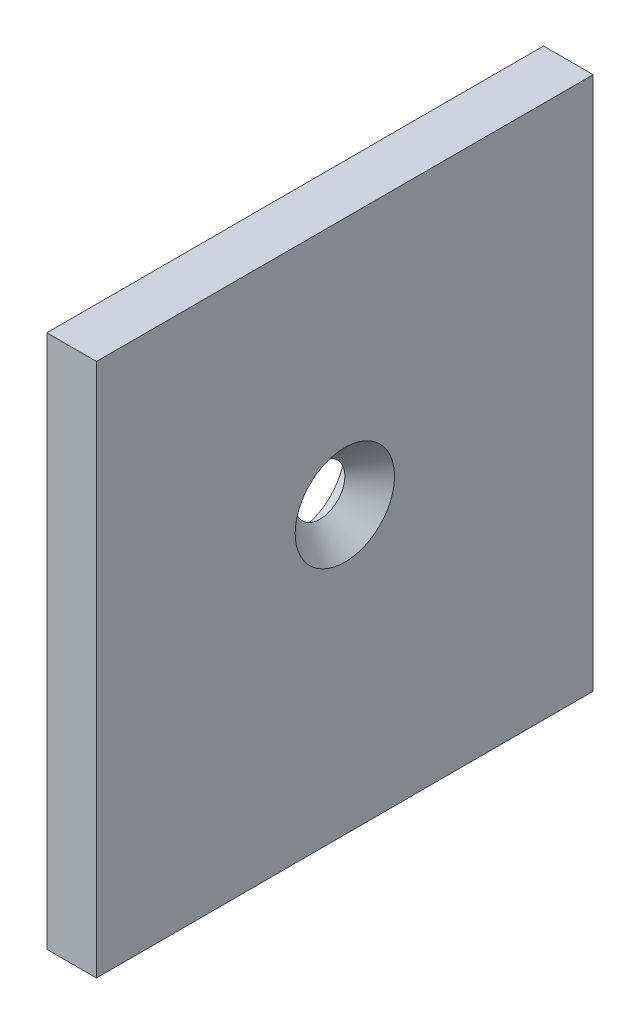
ISO-10303-21;
HEADER;
FILE_DESCRIPTION(('STEP AP214'),'2;1');
FILE_NAME('part.step','',(''),(''),'','','');
FILE_SCHEMA(('AUTOMOTIVE_DESIGN { 1 0 10303 214 1 1 1 1 }'));
ENDSEC;
DATA;
#1=APPLICATION_CONTEXT('core data for automotive mechanical design processes');
#2=APPLICATION_PROTOCOL_DEFINITION('international standard','automotive_design',2000,#1);
#3=PRODUCT_CONTEXT('',#1,'mechanical');
#4=PRODUCT('Part','Part','',(#3));
#5=PRODUCT_RELATED_PRODUCT_CATEGORY('part','',(#4));
#6=PRODUCT_DEFINITION_FORMATION('','',#4);
#7=PRODUCT_DEFINITION_CONTEXT('part definition',#1,'design');
#8=PRODUCT_DEFINITION('design','',#6,#7);
#9=PRODUCT_DEFINITION_SHAPE('','',#8);
#10=(LENGTH_UNIT() NAMED_UNIT(*) SI_UNIT(.MILLI.,.METRE.));
#11=(NAMED_UNIT(*) PLANE_ANGLE_UNIT() SI_UNIT($,.RADIAN.));
#12=(NAMED_UNIT(*) SI_UNIT($,.STERADIAN.) SOLID_ANGLE_UNIT());
#13=UNCERTAINTY_MEASURE_WITH_UNIT(LENGTH_MEASURE(1.E-05),#10,'distance_accuracy_value','');
#14=(GEOMETRIC_REPRESENTATION_CONTEXT(3) GLOBAL_UNCERTAINTY_ASSIGNED_CONTEXT((#13)) GLOBAL_UNIT_ASSIGNED_CONTEXT((#10,
#11,#12)) REPRESENTATION_CONTEXT('',''));
#15=CARTESIAN_POINT('',(0.,0.,0.));
#16=DIRECTION('',(0.,0.,1.));
#17=DIRECTION('',(1.,0.,0.));
#18=AXIS2_PLACEMENT_3D('',#15,#16,#17);
#19=CARTESIAN_POINT('',(0.,0.,40.));
#20=DIRECTION('',(0.,1.,0.));
#21=DIRECTION('',(0.,0.,1.));
#22=AXIS2_PLACEMENT_3D('',#19,#20,#21);
#23=PLANE('',#22);
#24=DIRECTION('',(1.,0.,0.));
#25=VECTOR('',#24,1.);
#26=CARTESIAN_POINT('',(0.,0.,0.));
#27=LINE('',#26,#25);
#28=CARTESIAN_POINT('',(0.,0.,0.));
#29=VERTEX_POINT('',#28);
#30=CARTESIAN_POINT('',(4.,0.,0.));
#31=VERTEX_POINT('',#30);
#32=EDGE_CURVE('E98',#29,#31,#27,.T.);
#33=ORIENTED_EDGE('',*,*,#32,.T.);
#34=DIRECTION('',(0.,0.,-1.));
#35=VECTOR('',#34,1.);
#36=CARTESIAN_POINT('',(4.,0.,40.));
#37=LINE('',#36,#35);
#38=CARTESIAN_POINT('',(4.,0.,40.));
#39=VERTEX_POINT('',#38);
#40=EDGE_CURVE('E40',#39,#31,#37,.T.);
#41=ORIENTED_EDGE('',*,*,#40,.F.);
#42=DIRECTION('',(1.,0.,0.));
#43=VECTOR('',#42,1.);
#44=CARTESIAN_POINT('',(0.,0.,40.));
#45=LINE('',#44,#43);
#46=CARTESIAN_POINT('',(0.,0.,40.));
#47=VERTEX_POINT('',#46);
#48=EDGE_CURVE('E84',#47,#39,#45,.T.);
#49=ORIENTED_EDGE('',*,*,#48,.F.);
#50=DIRECTION('',(0.,0.,-1.));
#51=VECTOR('',#50,1.);
#52=CARTESIAN_POINT('',(0.,0.,40.));
#53=LINE('',#52,#51);
#54=EDGE_CURVE('E94',#47,#29,#53,.T.);
#55=ORIENTED_EDGE('',*,*,#54,.T.);
#56=EDGE_LOOP('',(#33,#41,#49,#55));
#57=FACE_BOUND('',#56,.T.);
#58=ADVANCED_FACE('F31',(#57),#23,.F.);
#59=CARTESIAN_POINT('',(4.,0.,40.));
#60=DIRECTION('',(-1.,0.,0.));
#61=DIRECTION('',(0.,0.,1.));
#62=AXIS2_PLACEMENT_3D('',#59,#60,#61);
#63=PLANE('',#62);
#64=CARTESIAN_POINT('',(4.,23.,20.));
#65=DIRECTION('',(-1.,0.,0.));
#66=DIRECTION('',(0.,0.,1.));
#67=AXIS2_PLACEMENT_3D('',#64,#65,#66);
#68=CIRCLE('',#67,4.);
#69=CARTESIAN_POINT('',(4.,23.,24.));
#70=VERTEX_POINT('',#69);
#71=EDGE_CURVE('E11',#70,#70,#68,.T.);
#72=ORIENTED_EDGE('',*,*,#71,.T.);
#73=EDGE_LOOP('',(#72));
#74=FACE_BOUND('',#73,.T.);
#75=DIRECTION('',(0.,1.,0.));
#76=VECTOR('',#75,1.);
#77=CARTESIAN_POINT('',(4.,0.,0.));
#78=LINE('',#77,#76);
#79=CARTESIAN_POINT('',(4.,43.,0.));
#80=VERTEX_POINT('',#79);
#81=EDGE_CURVE('E89',#31,#80,#78,.T.);
#82=ORIENTED_EDGE('',*,*,#81,.T.);
#83=DIRECTION('',(0.,0.,-1.));
#84=VECTOR('',#83,1.);
#85=CARTESIAN_POINT('',(4.,43.,40.));
#86=LINE('',#85,#84);
#87=CARTESIAN_POINT('',(4.,43.,40.));
#88=VERTEX_POINT('',#87);
#89=EDGE_CURVE('E87',#88,#80,#86,.T.);
#90=ORIENTED_EDGE('',*,*,#89,.F.);
#91=DIRECTION('',(0.,1.,0.));
#92=VECTOR('',#91,1.);
#93=CARTESIAN_POINT('',(4.,0.,40.));
#94=LINE('',#93,#92);
#95=EDGE_CURVE('E79',#39,#88,#94,.T.);
#96=ORIENTED_EDGE('',*,*,#95,.F.);
#97=ORIENTED_EDGE('',*,*,#40,.T.);
#98=EDGE_LOOP('',(#82,#90,#96,#97));
#99=FACE_BOUND('',#98,.T.);
#100=ADVANCED_FACE('F88',(#74,#99),#63,.F.);
#101=CARTESIAN_POINT('',(4.,43.,40.));
#102=DIRECTION('',(0.,-1.,0.));
#103=DIRECTION('',(0.,0.,-1.));
#104=AXIS2_PLACEMENT_3D('',#101,#102,#103);
#105=PLANE('',#104);
#106=DIRECTION('',(-1.,0.,0.));
#107=VECTOR('',#106,1.);
#108=CARTESIAN_POINT('',(4.,43.,0.));
#109=LINE('',#108,#107);
#110=CARTESIAN_POINT('',(0.,43.,0.));
#111=VERTEX_POINT('',#110);
#112=EDGE_CURVE('E65',#80,#111,#109,.T.);
#113=ORIENTED_EDGE('',*,*,#112,.T.);
#114=DIRECTION('',(0.,0.,-1.));
#115=VECTOR('',#114,1.);
#116=CARTESIAN_POINT('',(0.,43.,40.));
#117=LINE('',#116,#115);
#118=CARTESIAN_POINT('',(0.,43.,40.));
#119=VERTEX_POINT('',#118);
#120=EDGE_CURVE('E90',#119,#111,#117,.T.);
#121=ORIENTED_EDGE('',*,*,#120,.F.);
#122=DIRECTION('',(-1.,0.,0.));
#123=VECTOR('',#122,1.);
#124=CARTESIAN_POINT('',(4.,43.,40.));
#125=LINE('',#124,#123);
#126=EDGE_CURVE('E82',#88,#119,#125,.T.);
#127=ORIENTED_EDGE('',*,*,#126,.F.);
#128=ORIENTED_EDGE('',*,*,#89,.T.);
#129=EDGE_LOOP('',(#113,#121,#127,#128));
#130=FACE_BOUND('',#129,.T.);
#131=ADVANCED_FACE('F92',(#130),#105,.F.);
#132=CARTESIAN_POINT('',(0.,0.,40.));
#133=DIRECTION('',(1.,0.,0.));
#134=DIRECTION('',(0.,0.,-1.));
#135=AXIS2_PLACEMENT_3D('',#132,#133,#134);
#136=PLANE('',#135);
#137=CARTESIAN_POINT('',(0.,23.,20.));
#138=DIRECTION('',(-1.,0.,0.));
#139=DIRECTION('',(0.,0.,1.));
#140=AXIS2_PLACEMENT_3D('',#137,#138,#139);
#141=CIRCLE('',#140,4.);
#142=CARTESIAN_POINT('',(0.,23.,24.));
#143=VERTEX_POINT('',#142);
#144=EDGE_CURVE('E112',#143,#143,#141,.T.);
#145=ORIENTED_EDGE('',*,*,#144,.F.);
#146=EDGE_LOOP('',(#145));
#147=FACE_BOUND('',#146,.T.);
#148=DIRECTION('',(0.,-1.,0.));
#149=VECTOR('',#148,1.);
#150=CARTESIAN_POINT('',(0.,0.,0.));
#151=LINE('',#150,#149);
#152=EDGE_CURVE('E71',#111,#29,#151,.T.);
#153=ORIENTED_EDGE('',*,*,#152,.T.);
#154=ORIENTED_EDGE('',*,*,#54,.F.);
#155=DIRECTION('',(0.,-1.,0.));
#156=VECTOR('',#155,1.);
#157=CARTESIAN_POINT('',(0.,0.,40.));
#158=LINE('',#157,#156);
#159=EDGE_CURVE('E48',#119,#47,#158,.T.);
#160=ORIENTED_EDGE('',*,*,#159,.F.);
#161=ORIENTED_EDGE('',*,*,#120,.T.);
#162=EDGE_LOOP('',(#153,#154,#160,#161));
#163=FACE_BOUND('',#162,.T.);
#164=ADVANCED_FACE('F122',(#147,#163),#136,.F.);
#165=CARTESIAN_POINT('',(4.,0.,40.));
#166=DIRECTION('',(0.,0.,1.));
#167=DIRECTION('',(1.,0.,0.));
#168=AXIS2_PLACEMENT_3D('',#165,#166,#167);
#169=PLANE('',#168);
#170=ORIENTED_EDGE('',*,*,#48,.T.);
#171=ORIENTED_EDGE('',*,*,#95,.T.);
#172=ORIENTED_EDGE('',*,*,#126,.T.);
#173=ORIENTED_EDGE('',*,*,#159,.T.);
#174=EDGE_LOOP('',(#170,#171,#172,#173));
#175=FACE_BOUND('',#174,.T.);
#176=ADVANCED_FACE('F80',(#175),#169,.T.);
#177=CARTESIAN_POINT('',(4.,0.,0.));
#178=DIRECTION('',(0.,0.,1.));
#179=DIRECTION('',(1.,0.,0.));
#180=AXIS2_PLACEMENT_3D('',#177,#178,#179);
#181=PLANE('',#180);
#182=ORIENTED_EDGE('',*,*,#32,.F.);
#183=ORIENTED_EDGE('',*,*,#152,.F.);
#184=ORIENTED_EDGE('',*,*,#112,.F.);
#185=ORIENTED_EDGE('',*,*,#81,.F.);
#186=EDGE_LOOP('',(#182,#183,#184,#185));
#187=FACE_BOUND('',#186,.T.);
#188=ADVANCED_FACE('F129',(#187),#181,.F.);
#189=CARTESIAN_POINT('',(2.,23.,20.));
#190=DIRECTION('',(-1.,0.,0.));
#191=DIRECTION('',(0.,0.,1.));
#192=AXIS2_PLACEMENT_3D('',#189,#190,#191);
#193=PLANE('',#192);
#194=CARTESIAN_POINT('',(2.,23.,20.));
#195=DIRECTION('',(-1.,0.,0.));
#196=DIRECTION('',(0.,0.,1.));
#197=AXIS2_PLACEMENT_3D('',#194,#195,#196);
#198=CIRCLE('',#197,4.);
#199=CARTESIAN_POINT('',(2.,23.,24.));
#200=VERTEX_POINT('',#199);
#201=EDGE_CURVE('E108',#200,#200,#198,.T.);
#202=ORIENTED_EDGE('',*,*,#201,.T.);
#203=EDGE_LOOP('',(#202));
#204=FACE_BOUND('',#203,.T.);
#205=CARTESIAN_POINT('',(2.,23.,20.));
#206=DIRECTION('',(-1.,0.,0.));
#207=DIRECTION('',(0.,0.,1.));
#208=AXIS2_PLACEMENT_3D('',#205,#206,#207);
#209=CIRCLE('',#208,2.);
#210=CARTESIAN_POINT('',(2.,23.,22.));
#211=VERTEX_POINT('',#210);
#212=EDGE_CURVE('E101',#211,#211,#209,.F.);
#213=ORIENTED_EDGE('',*,*,#212,.T.);
#214=EDGE_LOOP('',(#213));
#215=FACE_BOUND('',#214,.T.);
#216=ADVANCED_FACE('F143',(#204,#215),#193,.T.);
#217=CARTESIAN_POINT('',(2.,23.,20.));
#218=DIRECTION('',(-1.,0.,0.));
#219=DIRECTION('',(0.,0.,1.));
#220=AXIS2_PLACEMENT_3D('',#217,#218,#219);
#221=CYLINDRICAL_SURFACE('',#220,4.);
#222=ORIENTED_EDGE('',*,*,#201,.F.);
#223=EDGE_LOOP('',(#222));
#224=FACE_BOUND('',#223,.T.);
#225=ORIENTED_EDGE('',*,*,#144,.T.);
#226=EDGE_LOOP('',(#225));
#227=FACE_BOUND('',#226,.T.);
#228=ADVANCED_FACE('F120',(#224,#227),#221,.F.);
#229=CARTESIAN_POINT('',(4.,23.,20.));
#230=DIRECTION('',(1.,0.,0.));
#231=DIRECTION('',(0.,0.,-1.));
#232=AXIS2_PLACEMENT_3D('',#229,#230,#231);
#233=CONICAL_SURFACE('',#232,4.,0.785398163397446);
#234=ORIENTED_EDGE('',*,*,#212,.F.);
#235=EDGE_LOOP('',(#234));
#236=FACE_BOUND('',#235,.T.);
#237=ORIENTED_EDGE('',*,*,#71,.F.);
#238=EDGE_LOOP('',(#237));
#239=FACE_BOUND('',#238,.T.);
#240=ADVANCED_FACE('F33',(#236,#239),#233,.F.);
#241=CLOSED_SHELL('',(#58,#100,#131,#164,#176,#188,#216,#228,#240));
#242=MANIFOLD_SOLID_BREP('B2',#241);
#243=ADVANCED_BREP_SHAPE_REPRESENTATION('',(#18,#242),#14);
#244=SHAPE_DEFINITION_REPRESENTATION(#9,#243);
ENDSEC;
END-ISO-10303-21;
